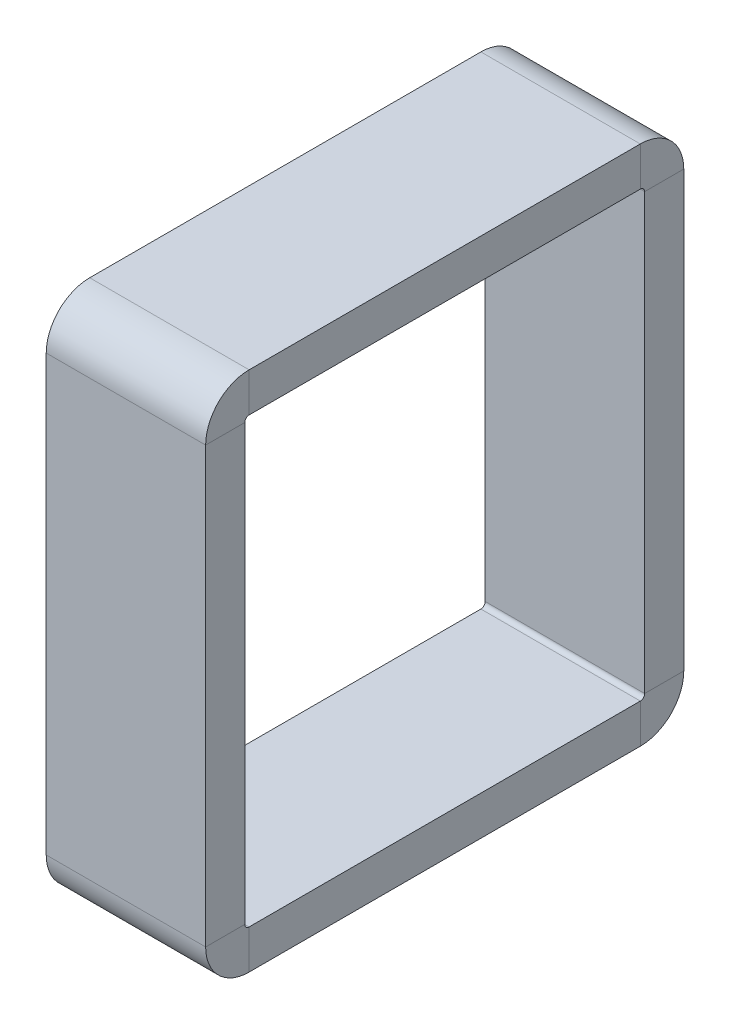
ISO-10303-21;
HEADER;
FILE_DESCRIPTION(('STEP AP214'),'2;1');
FILE_NAME('part.step','',(''),(''),'','','');
FILE_SCHEMA(('AUTOMOTIVE_DESIGN { 1 0 10303 214 1 1 1 1 }'));
ENDSEC;
DATA;
#1=APPLICATION_CONTEXT('core data for automotive mechanical design processes');
#2=APPLICATION_PROTOCOL_DEFINITION('international standard','automotive_design',2000,#1);
#3=PRODUCT_CONTEXT('',#1,'mechanical');
#4=PRODUCT('Part','Part','',(#3));
#5=PRODUCT_RELATED_PRODUCT_CATEGORY('part','',(#4));
#6=PRODUCT_DEFINITION_FORMATION('','',#4);
#7=PRODUCT_DEFINITION_CONTEXT('part definition',#1,'design');
#8=PRODUCT_DEFINITION('design','',#6,#7);
#9=PRODUCT_DEFINITION_SHAPE('','',#8);
#10=(LENGTH_UNIT() NAMED_UNIT(*) SI_UNIT(.MILLI.,.METRE.));
#11=(NAMED_UNIT(*) PLANE_ANGLE_UNIT() SI_UNIT($,.RADIAN.));
#12=(NAMED_UNIT(*) SI_UNIT($,.STERADIAN.) SOLID_ANGLE_UNIT());
#13=UNCERTAINTY_MEASURE_WITH_UNIT(LENGTH_MEASURE(1.E-05),#10,'distance_accuracy_value','');
#14=(GEOMETRIC_REPRESENTATION_CONTEXT(3) GLOBAL_UNCERTAINTY_ASSIGNED_CONTEXT((#13)) GLOBAL_UNIT_ASSIGNED_CONTEXT((#10,
#11,#12)) REPRESENTATION_CONTEXT('',''));
#15=CARTESIAN_POINT('',(0.,0.,0.));
#16=DIRECTION('',(0.,0.,1.));
#17=DIRECTION('',(1.,0.,0.));
#18=AXIS2_PLACEMENT_3D('',#15,#16,#17);
#19=CARTESIAN_POINT('',(-3.716777825355,-0.755000218992055,-3.24612158699929));
#20=DIRECTION('',(1.,0.,0.));
#21=DIRECTION('',(0.,8.74227765734758E-08,-1.));
#22=AXIS2_PLACEMENT_3D('',#19,#20,#21);
#23=PLANE('',#22);
#24=CARTESIAN_POINT('',(-3.716777825355,-0.750000218554938,-3.25112158656218));
#25=DIRECTION('',(-1.,0.,0.));
#26=DIRECTION('',(0.,0.999999999999996,8.74190497768613E-08));
#27=AXIS2_PLACEMENT_3D('',#24,#25,#26);
#28=CIRCLE('',#27,0.00999999999999601);
#29=CARTESIAN_POINT('',(-3.716777825355,-0.740000218554941,-3.25112158568795));
#30=VERTEX_POINT('',#29);
#31=CARTESIAN_POINT('',(-3.716777825355,-0.750000217681714,-3.26112158656218));
#32=VERTEX_POINT('',#31);
#33=EDGE_CURVE('E11',#30,#32,#28,.T.);
#34=ORIENTED_EDGE('',*,*,#33,.F.);
#35=DIRECTION('',(0.,-0.999999999999996,-8.74227801271606E-08));
#36=VECTOR('',#35,1.);
#37=CARTESIAN_POINT('',(-3.716777825355,-0.650000218555942,-3.2511215778209));
#38=LINE('',#37,#36);
#39=CARTESIAN_POINT('',(-3.716777825355,-0.650000218555942,-3.2511215778199));
#40=VERTEX_POINT('',#39);
#41=EDGE_CURVE('E295',#40,#30,#38,.T.);
#42=ORIENTED_EDGE('',*,*,#41,.F.);
#43=CARTESIAN_POINT('',(-3.716777825355,-0.750000218555609,-3.25112158656251));
#44=DIRECTION('',(1.,0.,0.));
#45=DIRECTION('',(0.,8.74290018163099E-08,-0.999999999999996));
#46=AXIS2_PLACEMENT_3D('',#43,#44,#45);
#47=CIRCLE('',#46,0.0999999999996679);
#48=CARTESIAN_POINT('',(-3.716777825355,-0.750000209813664,-3.35112158656218));
#49=VERTEX_POINT('',#48);
#50=EDGE_CURVE('E292',#49,#40,#47,.T.);
#51=ORIENTED_EDGE('',*,*,#50,.F.);
#52=DIRECTION('',(0.,8.74227825933516E-08,-0.999999999999996));
#53=VECTOR('',#52,1.);
#54=CARTESIAN_POINT('',(-3.716777825355,-0.750000217680714,-3.26112158656218));
#55=LINE('',#54,#53);
#56=EDGE_CURVE('E281',#32,#49,#55,.T.);
#57=ORIENTED_EDGE('',*,*,#56,.F.);
#58=EDGE_LOOP('',(#34,#42,#51,#57));
#59=FACE_BOUND('',#58,.T.);
#60=ADVANCED_FACE('F17',(#59),#23,.F.);
#61=CARTESIAN_POINT('',(-3.35,-0.755000218992055,-3.24612158699929));
#62=DIRECTION('',(1.,0.,0.));
#63=DIRECTION('',(0.,8.74227765734758E-08,-1.));
#64=AXIS2_PLACEMENT_3D('',#61,#62,#63);
#65=PLANE('',#64);
#66=DIRECTION('',(0.,8.74227764254459E-08,-0.999999999999996));
#67=VECTOR('',#66,1.);
#68=CARTESIAN_POINT('',(-3.35,-0.750000217680714,-3.26112158656218));
#69=LINE('',#68,#67);
#70=CARTESIAN_POINT('',(-3.35,-0.750000217681714,-3.26112158656218));
#71=VERTEX_POINT('',#70);
#72=CARTESIAN_POINT('',(-3.35,-0.750000209813664,-3.35112158656218));
#73=VERTEX_POINT('',#72);
#74=EDGE_CURVE('E24',#71,#73,#69,.T.);
#75=ORIENTED_EDGE('',*,*,#74,.T.);
#76=CARTESIAN_POINT('',(-3.35,-0.750000218555605,-3.25112158656251));
#77=DIRECTION('',(1.,0.,0.));
#78=DIRECTION('',(0.,8.7429410378383E-08,-0.999999999999996));
#79=AXIS2_PLACEMENT_3D('',#76,#77,#78);
#80=CIRCLE('',#79,0.0999999999996679);
#81=CARTESIAN_POINT('',(-3.35,-0.650000218554941,-3.2511215778199));
#82=VERTEX_POINT('',#81);
#83=EDGE_CURVE('E290',#73,#82,#80,.T.);
#84=ORIENTED_EDGE('',*,*,#83,.T.);
#85=DIRECTION('',(0.,0.999999999999996,8.74227801271606E-08));
#86=VECTOR('',#85,1.);
#87=CARTESIAN_POINT('',(-3.35,-0.740000218554941,-3.25112158568895));
#88=LINE('',#87,#86);
#89=CARTESIAN_POINT('',(-3.35,-0.740000218554941,-3.25112158568795));
#90=VERTEX_POINT('',#89);
#91=EDGE_CURVE('E284',#90,#82,#88,.T.);
#92=ORIENTED_EDGE('',*,*,#91,.F.);
#93=CARTESIAN_POINT('',(-3.35,-0.750000218554892,-3.25112158656223));
#94=DIRECTION('',(-1.,0.,0.));
#95=DIRECTION('',(0.,0.999999999999996,8.74276651075324E-08));
#96=AXIS2_PLACEMENT_3D('',#93,#94,#95);
#97=CIRCLE('',#96,0.00999999999999601);
#98=EDGE_CURVE('E274',#90,#71,#97,.T.);
#99=ORIENTED_EDGE('',*,*,#98,.T.);
#100=EDGE_LOOP('',(#75,#84,#92,#99));
#101=FACE_BOUND('',#100,.T.);
#102=ADVANCED_FACE('F409',(#101),#65,.T.);
#103=CARTESIAN_POINT('',(-3.716777825355,-0.750000218555609,-3.25112158656251));
#104=DIRECTION('',(1.,0.,0.));
#105=DIRECTION('',(0.,-1.,-8.74227765734759E-08));
#106=AXIS2_PLACEMENT_3D('',#103,#104,#105);
#107=CYLINDRICAL_SURFACE('',#106,0.0999999999996679);
#108=ORIENTED_EDGE('',*,*,#50,.T.);
#109=DIRECTION('',(-1.,0.,0.));
#110=VECTOR('',#109,1.);
#111=CARTESIAN_POINT('',(-3.35,-0.650000218555942,-3.2511215778209));
#112=LINE('',#111,#110);
#113=EDGE_CURVE('E287',#82,#40,#112,.T.);
#114=ORIENTED_EDGE('',*,*,#113,.F.);
#115=ORIENTED_EDGE('',*,*,#83,.F.);
#116=DIRECTION('',(1.,0.,0.));
#117=VECTOR('',#116,1.);
#118=CARTESIAN_POINT('',(-3.716777825355,-0.750000209812664,-3.35112158656218));
#119=LINE('',#118,#117);
#120=EDGE_CURVE('E268',#49,#73,#119,.T.);
#121=ORIENTED_EDGE('',*,*,#120,.F.);
#122=EDGE_LOOP('',(#108,#114,#115,#121));
#123=FACE_BOUND('',#122,.T.);
#124=ADVANCED_FACE('F345',(#123),#107,.T.);
#125=CARTESIAN_POINT('',(-3.716777825355,-0.750000218554938,-3.25112158656218));
#126=DIRECTION('',(-1.,-1.22913554664582E-13,1.22913533173692E-13));
#127=DIRECTION('',(1.22913543919138E-13,-1.,-8.74227765734759E-08));
#128=AXIS2_PLACEMENT_3D('',#125,#126,#127);
#129=CYLINDRICAL_SURFACE('',#128,0.00999999999999601);
#130=ORIENTED_EDGE('',*,*,#33,.T.);
#131=DIRECTION('',(1.,1.36334428017066E-12,0.));
#132=VECTOR('',#131,1.);
#133=CARTESIAN_POINT('',(-3.716777825355,-0.750000217680963,-3.26112158656218));
#134=LINE('',#133,#132);
#135=EDGE_CURVE('E276',#32,#71,#134,.T.);
#136=ORIENTED_EDGE('',*,*,#135,.T.);
#137=ORIENTED_EDGE('',*,*,#98,.F.);
#138=DIRECTION('',(1.,0.,0.));
#139=VECTOR('',#138,1.);
#140=CARTESIAN_POINT('',(-3.716777825355,-0.740000218554941,-3.25112158568895));
#141=LINE('',#140,#139);
#142=EDGE_CURVE('E262',#30,#90,#141,.T.);
#143=ORIENTED_EDGE('',*,*,#142,.F.);
#144=EDGE_LOOP('',(#130,#136,#137,#143));
#145=FACE_BOUND('',#144,.T.);
#146=ADVANCED_FACE('F304',(#145),#129,.F.);
#147=CARTESIAN_POINT('',(-3.716777825355,-0.65000029723644,-2.3511215778209));
#148=DIRECTION('',(1.,0.,0.));
#149=DIRECTION('',(0.,-1.,-8.74227765734759E-08));
#150=AXIS2_PLACEMENT_3D('',#147,#148,#149);
#151=PLANE('',#150);
#152=DIRECTION('',(0.,8.7422776548804E-08,-0.999999999999996));
#153=VECTOR('',#152,1.);
#154=CARTESIAN_POINT('',(-3.716777825355,-0.65000029723644,-2.3511215778209));
#155=LINE('',#154,#153);
#156=CARTESIAN_POINT('',(-3.716777825354,-0.65000029723944,-2.3511215778179));
#157=VERTEX_POINT('',#156);
#158=EDGE_CURVE('E278',#157,#40,#155,.T.);
#159=ORIENTED_EDGE('',*,*,#158,.T.);
#160=ORIENTED_EDGE('',*,*,#41,.T.);
#161=DIRECTION('',(0.,8.74227765488039E-08,-0.999999999999996));
#162=VECTOR('',#161,1.);
#163=CARTESIAN_POINT('',(-3.716777825355,-0.74000029723544,-2.35112158568895));
#164=LINE('',#163,#162);
#165=CARTESIAN_POINT('',(-3.716777825354,-0.74000029723844,-2.35112158568595));
#166=VERTEX_POINT('',#165);
#167=EDGE_CURVE('E265',#166,#30,#164,.T.);
#168=ORIENTED_EDGE('',*,*,#167,.F.);
#169=DIRECTION('',(0.,-0.999999999999996,-8.74121663959725E-08));
#170=VECTOR('',#169,1.);
#171=CARTESIAN_POINT('',(-3.716777825354,-0.650000297237395,-2.35112157782185));
#172=LINE('',#171,#170);
#173=EDGE_CURVE('E147',#157,#166,#172,.T.);
#174=ORIENTED_EDGE('',*,*,#173,.F.);
#175=EDGE_LOOP('',(#159,#160,#168,#174));
#176=FACE_BOUND('',#175,.T.);
#177=ADVANCED_FACE('F297',(#176),#151,.F.);
#178=CARTESIAN_POINT('',(-3.35,-0.65000029723644,-2.3511215778209));
#179=DIRECTION('',(0.,-1.,-8.74227765734759E-08));
#180=DIRECTION('',(-1.,0.,0.));
#181=AXIS2_PLACEMENT_3D('',#178,#179,#180);
#182=PLANE('',#181);
#183=DIRECTION('',(0.,8.7422776548804E-08,-0.999999999999996));
#184=VECTOR('',#183,1.);
#185=CARTESIAN_POINT('',(-3.35,-0.65000029723644,-2.3511215778209));
#186=LINE('',#185,#184);
#187=CARTESIAN_POINT('',(-3.350000000001,-0.65000029723944,-2.3511215778179));
#188=VERTEX_POINT('',#187);
#189=EDGE_CURVE('E271',#188,#82,#186,.T.);
#190=ORIENTED_EDGE('',*,*,#189,.T.);
#191=ORIENTED_EDGE('',*,*,#113,.T.);
#192=ORIENTED_EDGE('',*,*,#158,.F.);
#193=DIRECTION('',(-1.,0.,0.));
#194=VECTOR('',#193,1.);
#195=CARTESIAN_POINT('',(-3.35,-0.65000029723644,-2.3511215778209));
#196=LINE('',#195,#194);
#197=EDGE_CURVE('E255',#188,#157,#196,.T.);
#198=ORIENTED_EDGE('',*,*,#197,.F.);
#199=EDGE_LOOP('',(#190,#191,#192,#198));
#200=FACE_BOUND('',#199,.T.);
#201=ADVANCED_FACE('F342',(#200),#182,.F.);
#202=CARTESIAN_POINT('',(-3.716777825355,-0.74000029723544,-2.35112158568895));
#203=DIRECTION('',(0.,1.,8.74227765734759E-08));
#204=DIRECTION('',(1.,0.,0.));
#205=AXIS2_PLACEMENT_3D('',#202,#203,#204);
#206=PLANE('',#205);
#207=ORIENTED_EDGE('',*,*,#167,.T.);
#208=ORIENTED_EDGE('',*,*,#142,.T.);
#209=DIRECTION('',(0.,8.74227765488039E-08,-0.999999999999996));
#210=VECTOR('',#209,1.);
#211=CARTESIAN_POINT('',(-3.35,-0.74000029723544,-2.35112158568895));
#212=LINE('',#211,#210);
#213=CARTESIAN_POINT('',(-3.350000000001,-0.74000029723844,-2.35112158568595));
#214=VERTEX_POINT('',#213);
#215=EDGE_CURVE('E259',#214,#90,#212,.T.);
#216=ORIENTED_EDGE('',*,*,#215,.F.);
#217=DIRECTION('',(1.,0.,0.));
#218=VECTOR('',#217,1.);
#219=CARTESIAN_POINT('',(-3.716777825355,-0.74000029723544,-2.35112158568895));
#220=LINE('',#219,#218);
#221=EDGE_CURVE('E251',#166,#214,#220,.T.);
#222=ORIENTED_EDGE('',*,*,#221,.F.);
#223=EDGE_LOOP('',(#207,#208,#216,#222));
#224=FACE_BOUND('',#223,.T.);
#225=ADVANCED_FACE('F301',(#224),#206,.F.);
#226=CARTESIAN_POINT('',(-3.35,-0.74000029723544,-2.35112158568895));
#227=DIRECTION('',(-1.,0.,0.));
#228=DIRECTION('',(0.,1.,8.74227765734759E-08));
#229=AXIS2_PLACEMENT_3D('',#226,#227,#228);
#230=PLANE('',#229);
#231=ORIENTED_EDGE('',*,*,#215,.T.);
#232=ORIENTED_EDGE('',*,*,#91,.T.);
#233=ORIENTED_EDGE('',*,*,#189,.F.);
#234=DIRECTION('',(0.,0.999999999999996,8.7423199544488E-08));
#235=VECTOR('',#234,1.);
#236=CARTESIAN_POINT('',(-3.350000000001,-0.740000297235708,-2.35112158568899));
#237=LINE('',#236,#235);
#238=EDGE_CURVE('E242',#214,#188,#237,.T.);
#239=ORIENTED_EDGE('',*,*,#238,.F.);
#240=EDGE_LOOP('',(#231,#232,#233,#239));
#241=FACE_BOUND('',#240,.T.);
#242=ADVANCED_FACE('F308',(#241),#230,.F.);
#243=CARTESIAN_POINT('',(-3.716777825355,-1.80000020544153,-3.40112167835709));
#244=DIRECTION('',(-1.,0.,0.));
#245=DIRECTION('',(0.,-8.74227765734759E-08,1.));
#246=AXIS2_PLACEMENT_3D('',#243,#244,#245);
#247=PLANE('',#246);
#248=ORIENTED_EDGE('',*,*,#56,.T.);
#249=DIRECTION('',(0.,-0.999999999999996,-8.74247767512767E-08));
#250=VECTOR('',#249,1.);
#251=CARTESIAN_POINT('',(-3.716777825355,-0.750000209812664,-3.35112158656218));
#252=LINE('',#251,#250);
#253=CARTESIAN_POINT('',(-3.716777825355,-1.75000020981166,-3.35112167398595));
#254=VERTEX_POINT('',#253);
#255=EDGE_CURVE('E253',#49,#254,#252,.T.);
#256=ORIENTED_EDGE('',*,*,#255,.T.);
#257=DIRECTION('',(0.,-8.74338872897881E-08,0.999999999999996));
#258=VECTOR('',#257,1.);
#259=CARTESIAN_POINT('',(-3.716777825355,-1.75000020981266,-3.35112167398695));
#260=LINE('',#259,#258);
#261=CARTESIAN_POINT('',(-3.716777825354,-1.75000021768071,-3.26112167398595));
#262=VERTEX_POINT('',#261);
#263=EDGE_CURVE('E245',#254,#262,#260,.T.);
#264=ORIENTED_EDGE('',*,*,#263,.T.);
#265=DIRECTION('',(0.,0.999999999999996,8.74237762181995E-08));
#266=VECTOR('',#265,1.);
#267=CARTESIAN_POINT('',(-3.716777825355,-1.75000021768171,-3.26112167398595));
#268=LINE('',#267,#266);
#269=EDGE_CURVE('E233',#262,#32,#268,.T.);
#270=ORIENTED_EDGE('',*,*,#269,.T.);
#271=EDGE_LOOP('',(#248,#256,#264,#270));
#272=FACE_BOUND('',#271,.T.);
#273=ADVANCED_FACE('F350',(#272),#247,.T.);
#274=CARTESIAN_POINT('',(-3.716777825355,-0.750000209812664,-3.35112158656218));
#275=DIRECTION('',(0.,-8.7424776751277E-08,1.));
#276=DIRECTION('',(0.,-1.,-8.7424776751277E-08));
#277=AXIS2_PLACEMENT_3D('',#274,#275,#276);
#278=PLANE('',#277);
#279=ORIENTED_EDGE('',*,*,#120,.T.);
#280=DIRECTION('',(0.,-0.999999999999996,-8.74247767512767E-08));
#281=VECTOR('',#280,1.);
#282=CARTESIAN_POINT('',(-3.35,-0.750000209812664,-3.35112158656218));
#283=LINE('',#282,#281);
#284=CARTESIAN_POINT('',(-3.350000000001,-1.75000020981166,-3.35112167398595));
#285=VERTEX_POINT('',#284);
#286=EDGE_CURVE('E247',#73,#285,#283,.T.);
#287=ORIENTED_EDGE('',*,*,#286,.T.);
#288=DIRECTION('',(1.,0.,0.));
#289=VECTOR('',#288,1.);
#290=CARTESIAN_POINT('',(-3.716777825355,-1.75000020981266,-3.35112167398695));
#291=LINE('',#290,#289);
#292=EDGE_CURVE('E236',#254,#285,#291,.T.);
#293=ORIENTED_EDGE('',*,*,#292,.F.);
#294=ORIENTED_EDGE('',*,*,#255,.F.);
#295=EDGE_LOOP('',(#279,#287,#293,#294));
#296=FACE_BOUND('',#295,.T.);
#297=ADVANCED_FACE('F364',(#296),#278,.F.);
#298=CARTESIAN_POINT('',(-3.716777825355,-1.75000021768171,-3.26112167398595));
#299=DIRECTION('',(0.,8.74237762182872E-08,-1.));
#300=DIRECTION('',(0.,1.,8.74237762182872E-08));
#301=AXIS2_PLACEMENT_3D('',#298,#299,#300);
#302=PLANE('',#301);
#303=DIRECTION('',(1.,1.36334428017066E-12,0.));
#304=VECTOR('',#303,1.);
#305=CARTESIAN_POINT('',(-3.716777825355,-1.75000021768146,-3.26112167398595));
#306=LINE('',#305,#304);
#307=CARTESIAN_POINT('',(-3.350000000001,-1.75000021767971,-3.26112167398595));
#308=VERTEX_POINT('',#307);
#309=EDGE_CURVE('E249',#262,#308,#306,.T.);
#310=ORIENTED_EDGE('',*,*,#309,.T.);
#311=DIRECTION('',(0.,0.999999999999996,8.74237762182432E-08));
#312=VECTOR('',#311,1.);
#313=CARTESIAN_POINT('',(-3.35,-1.75000021768096,-3.26112167398595));
#314=LINE('',#313,#312);
#315=EDGE_CURVE('E239',#308,#71,#314,.T.);
#316=ORIENTED_EDGE('',*,*,#315,.T.);
#317=ORIENTED_EDGE('',*,*,#135,.F.);
#318=ORIENTED_EDGE('',*,*,#269,.F.);
#319=EDGE_LOOP('',(#310,#316,#317,#318));
#320=FACE_BOUND('',#319,.T.);
#321=ADVANCED_FACE('F355',(#320),#302,.F.);
#322=CARTESIAN_POINT('',(-3.35,-1.80000020544153,-3.40112167835709));
#323=DIRECTION('',(-1.,0.,0.));
#324=DIRECTION('',(0.,-8.74227765734759E-08,1.));
#325=AXIS2_PLACEMENT_3D('',#322,#323,#324);
#326=PLANE('',#325);
#327=ORIENTED_EDGE('',*,*,#315,.F.);
#328=DIRECTION('',(0.,-8.74333864567739E-08,0.999999999999996));
#329=VECTOR('',#328,1.);
#330=CARTESIAN_POINT('',(-3.35,-1.75000020981171,-3.351121673986));
#331=LINE('',#330,#329);
#332=EDGE_CURVE('E228',#285,#308,#331,.T.);
#333=ORIENTED_EDGE('',*,*,#332,.F.);
#334=ORIENTED_EDGE('',*,*,#286,.F.);
#335=ORIENTED_EDGE('',*,*,#74,.F.);
#336=EDGE_LOOP('',(#327,#333,#334,#335));
#337=FACE_BOUND('',#336,.T.);
#338=ADVANCED_FACE('F361',(#337),#326,.F.);
#339=CARTESIAN_POINT('',(-3.716777825355,-1.85500021899106,-3.24612168316634));
#340=DIRECTION('',(1.,0.,0.));
#341=DIRECTION('',(0.,8.74227765734759E-08,-1.));
#342=AXIS2_PLACEMENT_3D('',#339,#340,#341);
#343=PLANE('',#342);
#344=CARTESIAN_POINT('',(-3.716777825355,-1.75000021855494,-3.25112167398596));
#345=DIRECTION('',(-1.,0.,0.));
#346=DIRECTION('',(0.,8.74249561633349E-08,-0.999999999999996));
#347=AXIS2_PLACEMENT_3D('',#344,#345,#346);
#348=CIRCLE('',#347,0.00999999999999801);
#349=CARTESIAN_POINT('',(-3.716777825354,-1.76000021855494,-3.25112167486018));
#350=VERTEX_POINT('',#349);
#351=EDGE_CURVE('E231',#262,#350,#348,.T.);
#352=ORIENTED_EDGE('',*,*,#351,.F.);
#353=ORIENTED_EDGE('',*,*,#263,.F.);
#354=CARTESIAN_POINT('',(-3.716777825355,-1.75000021855514,-3.25112167398716));
#355=DIRECTION('',(1.,0.,0.));
#356=DIRECTION('',(0.,-0.999999999999996,-8.74205197131629E-08));
#357=AXIS2_PLACEMENT_3D('',#354,#355,#356);
#358=CIRCLE('',#357,0.0999999999987971);
#359=CARTESIAN_POINT('',(-3.716777825354,-1.85000021855394,-3.25112168272823));
#360=VERTEX_POINT('',#359);
#361=EDGE_CURVE('E225',#360,#254,#358,.T.);
#362=ORIENTED_EDGE('',*,*,#361,.F.);
#363=DIRECTION('',(0.,-0.999999999999996,-8.7433882357407E-08));
#364=VECTOR('',#363,1.);
#365=CARTESIAN_POINT('',(-3.716777825355,-1.76000021855494,-3.25112167486018));
#366=LINE('',#365,#364);
#367=EDGE_CURVE('E215',#350,#360,#366,.T.);
#368=ORIENTED_EDGE('',*,*,#367,.F.);
#369=EDGE_LOOP('',(#352,#353,#362,#368));
#370=FACE_BOUND('',#369,.T.);
#371=ADVANCED_FACE('F372',(#370),#343,.F.);
#372=CARTESIAN_POINT('',(-3.716777825355,-1.75000021855514,-3.25112167398716));
#373=DIRECTION('',(1.,0.,0.));
#374=DIRECTION('',(0.,-1.,-8.74227765734759E-08));
#375=AXIS2_PLACEMENT_3D('',#372,#373,#374);
#376=CYLINDRICAL_SURFACE('',#375,0.0999999999987971);
#377=ORIENTED_EDGE('',*,*,#361,.T.);
#378=ORIENTED_EDGE('',*,*,#292,.T.);
#379=CARTESIAN_POINT('',(-3.35,-1.75000021855515,-3.25112167398716));
#380=DIRECTION('',(1.,0.,0.));
#381=DIRECTION('',(0.,-0.999999999999996,-8.74204753042419E-08));
#382=AXIS2_PLACEMENT_3D('',#379,#380,#381);
#383=CIRCLE('',#382,0.0999999999987971);
#384=CARTESIAN_POINT('',(-3.350000000001,-1.85000021855394,-3.25112168272823));
#385=VERTEX_POINT('',#384);
#386=EDGE_CURVE('E218',#385,#285,#383,.T.);
#387=ORIENTED_EDGE('',*,*,#386,.F.);
#388=DIRECTION('',(1.,0.,0.));
#389=VECTOR('',#388,1.);
#390=CARTESIAN_POINT('',(-3.716777825355,-1.85000021855394,-3.25112168272923));
#391=LINE('',#390,#389);
#392=EDGE_CURVE('E209',#360,#385,#391,.T.);
#393=ORIENTED_EDGE('',*,*,#392,.F.);
#394=EDGE_LOOP('',(#377,#378,#387,#393));
#395=FACE_BOUND('',#394,.T.);
#396=ADVANCED_FACE('F368',(#395),#376,.T.);
#397=CARTESIAN_POINT('',(-3.716777825355,-1.75000021855494,-3.25112167398596));
#398=DIRECTION('',(-1.,1.229135331737E-13,1.22913554664589E-13));
#399=DIRECTION('',(-1.22913543919143E-13,-1.,-8.74227765734759E-08));
#400=AXIS2_PLACEMENT_3D('',#397,#398,#399);
#401=CYLINDRICAL_SURFACE('',#400,0.00999999999999801);
#402=ORIENTED_EDGE('',*,*,#351,.T.);
#403=DIRECTION('',(1.,2.72668856034131E-12,0.));
#404=VECTOR('',#403,1.);
#405=CARTESIAN_POINT('',(-3.716777825355,-1.76000021855494,-3.25112167486018));
#406=LINE('',#405,#404);
#407=CARTESIAN_POINT('',(-3.350000000001,-1.76000021855394,-3.25112167486018));
#408=VERTEX_POINT('',#407);
#409=EDGE_CURVE('E221',#350,#408,#406,.T.);
#410=ORIENTED_EDGE('',*,*,#409,.T.);
#411=CARTESIAN_POINT('',(-3.35,-1.75000021855499,-3.251121673986));
#412=DIRECTION('',(-1.,0.,0.));
#413=DIRECTION('',(0.,8.75294947633336E-08,-0.999999999999996));
#414=AXIS2_PLACEMENT_3D('',#411,#412,#413);
#415=CIRCLE('',#414,0.00999999999999801);
#416=EDGE_CURVE('E212',#308,#408,#415,.T.);
#417=ORIENTED_EDGE('',*,*,#416,.F.);
#418=ORIENTED_EDGE('',*,*,#309,.F.);
#419=EDGE_LOOP('',(#402,#410,#417,#418));
#420=FACE_BOUND('',#419,.T.);
#421=ADVANCED_FACE('F374',(#420),#401,.F.);
#422=CARTESIAN_POINT('',(-3.35,-1.85500021899106,-3.24612168316634));
#423=DIRECTION('',(1.,0.,0.));
#424=DIRECTION('',(0.,8.74227765734759E-08,-1.));
#425=AXIS2_PLACEMENT_3D('',#422,#423,#424);
#426=PLANE('',#425);
#427=DIRECTION('',(0.,-0.999999999999996,-8.7434893892964E-08));
#428=VECTOR('',#427,1.);
#429=CARTESIAN_POINT('',(-3.35,-1.76000021855394,-3.25112167486009));
#430=LINE('',#429,#428);
#431=EDGE_CURVE('E223',#408,#385,#430,.T.);
#432=ORIENTED_EDGE('',*,*,#431,.T.);
#433=ORIENTED_EDGE('',*,*,#386,.T.);
#434=ORIENTED_EDGE('',*,*,#332,.T.);
#435=ORIENTED_EDGE('',*,*,#416,.T.);
#436=EDGE_LOOP('',(#432,#433,#434,#435));
#437=FACE_BOUND('',#436,.T.);
#438=ADVANCED_FACE('F377',(#437),#426,.T.);
#439=CARTESIAN_POINT('',(-3.716777825355,-1.89500021462292,-3.29612168666326));
#440=DIRECTION('',(-1.,0.,0.));
#441=DIRECTION('',(0.,-8.74227765734759E-08,1.));
#442=AXIS2_PLACEMENT_3D('',#439,#440,#441);
#443=PLANE('',#442);
#444=ORIENTED_EDGE('',*,*,#367,.T.);
#445=DIRECTION('',(0.,-8.74261100551144E-08,0.999999999999996));
#446=VECTOR('',#445,1.);
#447=CARTESIAN_POINT('',(-3.716777825355,-1.85000021855394,-3.25112168272923));
#448=LINE('',#447,#446);
#449=CARTESIAN_POINT('',(-3.716777825354,-1.85000029723744,-2.35112168273023));
#450=VERTEX_POINT('',#449);
#451=EDGE_CURVE('E207',#360,#450,#448,.T.);
#452=ORIENTED_EDGE('',*,*,#451,.T.);
#453=DIRECTION('',(0.,0.999999999999996,8.74227653232155E-08));
#454=VECTOR('',#453,1.);
#455=CARTESIAN_POINT('',(-3.716777825355,-1.85000029723744,-2.35112168272923));
#456=LINE('',#455,#454);
#457=CARTESIAN_POINT('',(-3.716777825354,-1.76000029723744,-2.35112167486118));
#458=VERTEX_POINT('',#457);
#459=EDGE_CURVE('E201',#450,#458,#456,.T.);
#460=ORIENTED_EDGE('',*,*,#459,.T.);
#461=DIRECTION('',(0.,8.74249985986058E-08,-0.999999999999996));
#462=VECTOR('',#461,1.);
#463=CARTESIAN_POINT('',(-3.716777825355,-1.76000029723744,-2.35112167486118));
#464=LINE('',#463,#462);
#465=EDGE_CURVE('E192',#458,#350,#464,.T.);
#466=ORIENTED_EDGE('',*,*,#465,.T.);
#467=EDGE_LOOP('',(#444,#452,#460,#466));
#468=FACE_BOUND('',#467,.T.);
#469=ADVANCED_FACE('F397',(#468),#443,.T.);
#470=CARTESIAN_POINT('',(-3.716777825355,-1.85000021855394,-3.25112168272923));
#471=DIRECTION('',(0.,1.,8.74261099564282E-08));
#472=DIRECTION('',(0.,-8.74261099564282E-08,1.));
#473=AXIS2_PLACEMENT_3D('',#470,#471,#472);
#474=PLANE('',#473);
#475=ORIENTED_EDGE('',*,*,#392,.T.);
#476=DIRECTION('',(0.,-8.74261100551145E-08,0.999999999999996));
#477=VECTOR('',#476,1.);
#478=CARTESIAN_POINT('',(-3.35,-1.85000021855394,-3.25112168272923));
#479=LINE('',#478,#477);
#480=CARTESIAN_POINT('',(-3.350000000001,-1.85000029723744,-2.35112168273023));
#481=VERTEX_POINT('',#480);
#482=EDGE_CURVE('E203',#385,#481,#479,.T.);
#483=ORIENTED_EDGE('',*,*,#482,.T.);
#484=DIRECTION('',(1.,0.,0.));
#485=VECTOR('',#484,1.);
#486=CARTESIAN_POINT('',(-3.716777825355,-1.85000029723744,-2.35112168272923));
#487=LINE('',#486,#485);
#488=EDGE_CURVE('E195',#450,#481,#487,.T.);
#489=ORIENTED_EDGE('',*,*,#488,.F.);
#490=ORIENTED_EDGE('',*,*,#451,.F.);
#491=EDGE_LOOP('',(#475,#483,#489,#490));
#492=FACE_BOUND('',#491,.T.);
#493=ADVANCED_FACE('F381',(#492),#474,.F.);
#494=CARTESIAN_POINT('',(-3.716777825355,-1.76000029723744,-2.35112167486118));
#495=DIRECTION('',(2.72668856034131E-12,-1.,-8.74249987465387E-08));
#496=DIRECTION('',(0.,8.74249987465387E-08,-1.));
#497=AXIS2_PLACEMENT_3D('',#494,#495,#496);
#498=PLANE('',#497);
#499=DIRECTION('',(1.,2.72668856034131E-12,0.));
#500=VECTOR('',#499,1.);
#501=CARTESIAN_POINT('',(-3.716777825355,-1.76000029723744,-2.35112167486118));
#502=LINE('',#501,#500);
#503=CARTESIAN_POINT('',(-3.350000000001,-1.76000029723744,-2.35112167486118));
#504=VERTEX_POINT('',#503);
#505=EDGE_CURVE('E205',#458,#504,#502,.T.);
#506=ORIENTED_EDGE('',*,*,#505,.T.);
#507=DIRECTION('',(0.,8.7424998845322E-08,-0.999999999999996));
#508=VECTOR('',#507,1.);
#509=CARTESIAN_POINT('',(-3.35,-1.76000029723644,-2.35112167486118));
#510=LINE('',#509,#508);
#511=EDGE_CURVE('E198',#504,#408,#510,.T.);
#512=ORIENTED_EDGE('',*,*,#511,.T.);
#513=ORIENTED_EDGE('',*,*,#409,.F.);
#514=ORIENTED_EDGE('',*,*,#465,.F.);
#515=EDGE_LOOP('',(#506,#512,#513,#514));
#516=FACE_BOUND('',#515,.T.);
#517=ADVANCED_FACE('F398',(#516),#498,.F.);
#518=CARTESIAN_POINT('',(-3.35,-1.89500021462292,-3.29612168666326));
#519=DIRECTION('',(-1.,0.,0.));
#520=DIRECTION('',(0.,-8.74227765734759E-08,1.));
#521=AXIS2_PLACEMENT_3D('',#518,#519,#520);
#522=PLANE('',#521);
#523=ORIENTED_EDGE('',*,*,#511,.F.);
#524=DIRECTION('',(0.,0.999999999999996,8.74227751918646E-08));
#525=VECTOR('',#524,1.);
#526=CARTESIAN_POINT('',(-3.350000000001,-1.85000029723744,-2.35112168272923));
#527=LINE('',#526,#525);
#528=EDGE_CURVE('E187',#481,#504,#527,.T.);
#529=ORIENTED_EDGE('',*,*,#528,.F.);
#530=ORIENTED_EDGE('',*,*,#482,.F.);
#531=ORIENTED_EDGE('',*,*,#431,.F.);
#532=EDGE_LOOP('',(#523,#529,#530,#531));
#533=FACE_BOUND('',#532,.T.);
#534=ADVANCED_FACE('F385',(#533),#522,.F.);
#535=CARTESIAN_POINT('',(-3.716777825354,-1.85500030641683,-2.24612168316734));
#536=DIRECTION('',(1.,0.,0.));
#537=DIRECTION('',(0.,8.74227765734759E-08,-1.));
#538=AXIS2_PLACEMENT_3D('',#535,#536,#537);
#539=PLANE('',#538);
#540=CARTESIAN_POINT('',(-3.716777825354,-1.75000029723744,-2.35112167398695));
#541=DIRECTION('',(-1.,0.,0.));
#542=DIRECTION('',(0.,-0.999999999999996,-8.74229577618769E-08));
#543=AXIS2_PLACEMENT_3D('',#540,#541,#542);
#544=CIRCLE('',#543,0.00999999999999957);
#545=CARTESIAN_POINT('',(-3.716777825354,-1.75000029811067,-2.34112167398695));
#546=VERTEX_POINT('',#545);
#547=EDGE_CURVE('E190',#458,#546,#544,.T.);
#548=ORIENTED_EDGE('',*,*,#547,.F.);
#549=ORIENTED_EDGE('',*,*,#459,.F.);
#550=CARTESIAN_POINT('',(-3.716777825354,-1.75000029723746,-2.35112167398793));
#551=DIRECTION('',(1.,0.,0.));
#552=DIRECTION('',(0.,-8.74225336566994E-08,0.999999999999996));
#553=AXIS2_PLACEMENT_3D('',#550,#551,#552);
#554=CIRCLE('',#553,0.0999999999999757);
#555=CARTESIAN_POINT('',(-3.716777825354,-1.75000030597972,-2.25112167398795));
#556=VERTEX_POINT('',#555);
#557=EDGE_CURVE('E184',#556,#450,#554,.T.);
#558=ORIENTED_EDGE('',*,*,#557,.F.);
#559=DIRECTION('',(0.,-8.74343930599545E-08,0.999999999999996));
#560=VECTOR('',#559,1.);
#561=CARTESIAN_POINT('',(-3.716777825354,-1.75000029811162,-2.341121673987));
#562=LINE('',#561,#560);
#563=EDGE_CURVE('E176',#546,#556,#562,.T.);
#564=ORIENTED_EDGE('',*,*,#563,.F.);
#565=EDGE_LOOP('',(#548,#549,#558,#564));
#566=FACE_BOUND('',#565,.T.);
#567=ADVANCED_FACE('F395',(#566),#539,.F.);
#568=CARTESIAN_POINT('',(-3.716777825354,-1.75000029723746,-2.35112167398793));
#569=DIRECTION('',(1.,0.,0.));
#570=DIRECTION('',(0.,-1.,-8.74227765734759E-08));
#571=AXIS2_PLACEMENT_3D('',#568,#569,#570);
#572=CYLINDRICAL_SURFACE('',#571,0.0999999999999757);
#573=ORIENTED_EDGE('',*,*,#557,.T.);
#574=ORIENTED_EDGE('',*,*,#488,.T.);
#575=CARTESIAN_POINT('',(-3.350000000001,-1.75000029723747,-2.35112167398792));
#576=DIRECTION('',(1.,0.,0.));
#577=DIRECTION('',(0.,-8.74224892477784E-08,0.999999999999996));
#578=AXIS2_PLACEMENT_3D('',#575,#576,#577);
#579=CIRCLE('',#578,0.0999999999999757);
#580=CARTESIAN_POINT('',(-3.350000000001,-1.75000030597972,-2.25112167398795));
#581=VERTEX_POINT('',#580);
#582=EDGE_CURVE('E178',#581,#481,#579,.T.);
#583=ORIENTED_EDGE('',*,*,#582,.F.);
#584=DIRECTION('',(1.,1.36334428017809E-12,0.));
#585=VECTOR('',#584,1.);
#586=CARTESIAN_POINT('',(-3.716777825354,-1.75000030598047,-2.25112167398795));
#587=LINE('',#586,#585);
#588=EDGE_CURVE('E167',#556,#581,#587,.T.);
#589=ORIENTED_EDGE('',*,*,#588,.F.);
#590=EDGE_LOOP('',(#573,#574,#583,#589));
#591=FACE_BOUND('',#590,.T.);
#592=ADVANCED_FACE('F335',(#591),#572,.T.);
#593=CARTESIAN_POINT('',(-3.716777825354,-1.75000029723744,-2.35112167398695));
#594=DIRECTION('',(-1.,1.22913554664589E-13,-1.229135331737E-13));
#595=DIRECTION('',(-1.22913543919146E-13,-1.,-8.74227765734759E-08));
#596=AXIS2_PLACEMENT_3D('',#593,#594,#595);
#597=CYLINDRICAL_SURFACE('',#596,0.00999999999999957);
#598=ORIENTED_EDGE('',*,*,#547,.T.);
#599=DIRECTION('',(1.,0.,0.));
#600=VECTOR('',#599,1.);
#601=CARTESIAN_POINT('',(-3.716777825354,-1.75000029811167,-2.34112167398695));
#602=LINE('',#601,#600);
#603=CARTESIAN_POINT('',(-3.350000000001,-1.75000029811067,-2.34112167398695));
#604=VERTEX_POINT('',#603);
#605=EDGE_CURVE('E158',#546,#604,#602,.T.);
#606=ORIENTED_EDGE('',*,*,#605,.T.);
#607=CARTESIAN_POINT('',(-3.350000000001,-1.75000029723749,-2.35112167398691));
#608=DIRECTION('',(-1.,0.,0.));
#609=DIRECTION('',(0.,-0.999999999999996,-8.74274874718174E-08));
#610=AXIS2_PLACEMENT_3D('',#607,#608,#609);
#611=CIRCLE('',#610,0.00999999999999957);
#612=EDGE_CURVE('E173',#504,#604,#611,.T.);
#613=ORIENTED_EDGE('',*,*,#612,.F.);
#614=ORIENTED_EDGE('',*,*,#505,.F.);
#615=EDGE_LOOP('',(#598,#606,#613,#614));
#616=FACE_BOUND('',#615,.T.);
#617=ADVANCED_FACE('F389',(#616),#597,.F.);
#618=CARTESIAN_POINT('',(-3.350000000001,-1.85500030641683,-2.24612168316734));
#619=DIRECTION('',(1.,0.,0.));
#620=DIRECTION('',(0.,8.74227765734759E-08,-1.));
#621=AXIS2_PLACEMENT_3D('',#618,#619,#620);
#622=PLANE('',#621);
#623=DIRECTION('',(0.,-8.74227727256735E-08,0.999999999999996));
#624=VECTOR('',#623,1.);
#625=CARTESIAN_POINT('',(-3.350000000001,-1.75000029811167,-2.34112167398695));
#626=LINE('',#625,#624);
#627=EDGE_CURVE('E182',#604,#581,#626,.T.);
#628=ORIENTED_EDGE('',*,*,#627,.T.);
#629=ORIENTED_EDGE('',*,*,#582,.T.);
#630=ORIENTED_EDGE('',*,*,#528,.T.);
#631=ORIENTED_EDGE('',*,*,#612,.T.);
#632=EDGE_LOOP('',(#628,#629,#630,#631));
#633=FACE_BOUND('',#632,.T.);
#634=ADVANCED_FACE('F331',(#633),#622,.T.);
#635=CARTESIAN_POINT('',(-3.716777825354,-1.80000029374153,-2.39112167835809));
#636=DIRECTION('',(-1.,0.,0.));
#637=DIRECTION('',(0.,-8.74227765734759E-08,1.));
#638=AXIS2_PLACEMENT_3D('',#635,#636,#637);
#639=PLANE('',#638);
#640=ORIENTED_EDGE('',*,*,#563,.T.);
#641=DIRECTION('',(0.,0.999999999999996,8.74268057947961E-08));
#642=VECTOR('',#641,1.);
#643=CARTESIAN_POINT('',(-3.716777825354,-1.75000030598064,-2.25112167398798));
#644=LINE('',#643,#642);
#645=CARTESIAN_POINT('',(-3.716777825354,-0.750000305980718,-2.25112158656118));
#646=VERTEX_POINT('',#645);
#647=EDGE_CURVE('E135',#556,#646,#644,.T.);
#648=ORIENTED_EDGE('',*,*,#647,.T.);
#649=DIRECTION('',(0.,8.74224125202244E-08,-0.999999999999996));
#650=VECTOR('',#649,1.);
#651=CARTESIAN_POINT('',(-3.716777825354,-0.750000305979685,-2.25112158656143));
#652=LINE('',#651,#650);
#653=CARTESIAN_POINT('',(-3.716777825354,-0.750000298112668,-2.34112158656018));
#654=VERTEX_POINT('',#653);
#655=EDGE_CURVE('E127',#646,#654,#652,.T.);
#656=ORIENTED_EDGE('',*,*,#655,.T.);
#657=DIRECTION('',(0.,-0.999999999999996,-8.74266858907895E-08));
#658=VECTOR('',#657,1.);
#659=CARTESIAN_POINT('',(-3.716777825354,-0.750000298111664,-2.34112158656027));
#660=LINE('',#659,#658);
#661=EDGE_CURVE('E132',#654,#546,#660,.T.);
#662=ORIENTED_EDGE('',*,*,#661,.T.);
#663=EDGE_LOOP('',(#640,#648,#656,#662));
#664=FACE_BOUND('',#663,.T.);
#665=ADVANCED_FACE('F130',(#664),#639,.T.);
#666=CARTESIAN_POINT('',(-3.716777825354,-1.75000030598072,-2.25112167398795));
#667=DIRECTION('',(0.,8.74267769290782E-08,-1.));
#668=DIRECTION('',(0.,1.,8.74267769290782E-08));
#669=AXIS2_PLACEMENT_3D('',#666,#667,#668);
#670=PLANE('',#669);
#671=ORIENTED_EDGE('',*,*,#588,.T.);
#672=DIRECTION('',(0.,0.999999999999996,8.74267769290341E-08));
#673=VECTOR('',#672,1.);
#674=CARTESIAN_POINT('',(-3.350000000001,-1.75000030597997,-2.25112167398795));
#675=LINE('',#674,#673);
#676=CARTESIAN_POINT('',(-3.350000000001,-0.750000305980718,-2.25112158656118));
#677=VERTEX_POINT('',#676);
#678=EDGE_CURVE('E139',#581,#677,#675,.T.);
#679=ORIENTED_EDGE('',*,*,#678,.T.);
#680=DIRECTION('',(1.,1.36334428017809E-12,0.));
#681=VECTOR('',#680,1.);
#682=CARTESIAN_POINT('',(-3.716777825354,-0.750000305979968,-2.25112158656118));
#683=LINE('',#682,#681);
#684=EDGE_CURVE('E159',#646,#677,#683,.T.);
#685=ORIENTED_EDGE('',*,*,#684,.F.);
#686=ORIENTED_EDGE('',*,*,#647,.F.);
#687=EDGE_LOOP('',(#671,#679,#685,#686));
#688=FACE_BOUND('',#687,.T.);
#689=ADVANCED_FACE('F338',(#688),#670,.F.);
#690=CARTESIAN_POINT('',(-3.716777825354,-0.750000298111668,-2.34112158656018));
#691=DIRECTION('',(0.,-8.7426776484989E-08,1.));
#692=DIRECTION('',(0.,-1.,-8.7426776484989E-08));
#693=AXIS2_PLACEMENT_3D('',#690,#691,#692);
#694=PLANE('',#693);
#695=DIRECTION('',(1.,0.,0.));
#696=VECTOR('',#695,1.);
#697=CARTESIAN_POINT('',(-3.716777825354,-0.750000298111668,-2.34112158656018));
#698=LINE('',#697,#696);
#699=CARTESIAN_POINT('',(-3.350000000001,-0.750000298112668,-2.34112158656018));
#700=VERTEX_POINT('',#699);
#701=EDGE_CURVE('E156',#654,#700,#698,.T.);
#702=ORIENTED_EDGE('',*,*,#701,.T.);
#703=DIRECTION('',(0.,-0.999999999999996,-8.74267764849886E-08));
#704=VECTOR('',#703,1.);
#705=CARTESIAN_POINT('',(-3.350000000001,-0.750000298111668,-2.34112158656018));
#706=LINE('',#705,#704);
#707=EDGE_CURVE('E140',#700,#604,#706,.T.);
#708=ORIENTED_EDGE('',*,*,#707,.T.);
#709=ORIENTED_EDGE('',*,*,#605,.F.);
#710=ORIENTED_EDGE('',*,*,#661,.F.);
#711=EDGE_LOOP('',(#702,#708,#709,#710));
#712=FACE_BOUND('',#711,.T.);
#713=ADVANCED_FACE('F154',(#712),#694,.F.);
#714=CARTESIAN_POINT('',(-3.350000000001,-1.80000029374053,-2.39112167835809));
#715=DIRECTION('',(-1.,0.,0.));
#716=DIRECTION('',(0.,-8.74227765734759E-08,1.));
#717=AXIS2_PLACEMENT_3D('',#714,#715,#716);
#718=PLANE('',#717);
#719=ORIENTED_EDGE('',*,*,#707,.F.);
#720=DIRECTION('',(0.,8.7423280961147E-08,-0.999999999999996));
#721=VECTOR('',#720,1.);
#722=CARTESIAN_POINT('',(-3.350000000001,-0.750000305979764,-2.25112158656122));
#723=LINE('',#722,#721);
#724=EDGE_CURVE('E151',#677,#700,#723,.T.);
#725=ORIENTED_EDGE('',*,*,#724,.F.);
#726=ORIENTED_EDGE('',*,*,#678,.F.);
#727=ORIENTED_EDGE('',*,*,#627,.F.);
#728=EDGE_LOOP('',(#719,#725,#726,#727));
#729=FACE_BOUND('',#728,.T.);
#730=ADVANCED_FACE('F328',(#729),#718,.F.);
#731=CARTESIAN_POINT('',(-3.716777825354,-0.755000306417832,-2.24612158699729));
#732=DIRECTION('',(1.,0.,0.));
#733=DIRECTION('',(0.,8.74227765734759E-08,-1.));
#734=AXIS2_PLACEMENT_3D('',#731,#732,#733);
#735=PLANE('',#734);
#736=CARTESIAN_POINT('',(-3.716777825354,-0.750000297238439,-2.35112158656017));
#737=DIRECTION('',(-1.,0.,0.));
#738=DIRECTION('',(0.,-8.74274874718271E-08,0.999999999999996));
#739=AXIS2_PLACEMENT_3D('',#736,#737,#738);
#740=CIRCLE('',#739,0.00999999999999845);
#741=EDGE_CURVE('E144',#654,#166,#740,.T.);
#742=ORIENTED_EDGE('',*,*,#741,.F.);
#743=ORIENTED_EDGE('',*,*,#655,.F.);
#744=CARTESIAN_POINT('',(-3.716777825354,-0.750000297237544,-2.35112158655928));
#745=DIRECTION('',(1.,0.,0.));
#746=DIRECTION('',(0.,0.999999999999996,8.7409035566802E-08));
#747=AXIS2_PLACEMENT_3D('',#744,#745,#746);
#748=CIRCLE('',#747,0.0999999999981039);
#749=EDGE_CURVE('E317',#157,#646,#748,.T.);
#750=ORIENTED_EDGE('',*,*,#749,.F.);
#751=ORIENTED_EDGE('',*,*,#173,.T.);
#752=EDGE_LOOP('',(#742,#743,#750,#751));
#753=FACE_BOUND('',#752,.T.);
#754=ADVANCED_FACE('F145',(#753),#735,.F.);
#755=CARTESIAN_POINT('',(-3.716777825354,-0.750000297237544,-2.35112158655928));
#756=DIRECTION('',(1.,0.,0.));
#757=DIRECTION('',(0.,-1.,-8.74227765734759E-08));
#758=AXIS2_PLACEMENT_3D('',#755,#756,#757);
#759=CYLINDRICAL_SURFACE('',#758,0.0999999999981039);
#760=ORIENTED_EDGE('',*,*,#749,.T.);
#761=ORIENTED_EDGE('',*,*,#684,.T.);
#762=CARTESIAN_POINT('',(-3.350000000001,-0.75000029723754,-2.35112158655927));
#763=DIRECTION('',(1.,0.,0.));
#764=DIRECTION('',(0.,0.999999999999996,8.7408991157881E-08));
#765=AXIS2_PLACEMENT_3D('',#762,#763,#764);
#766=CIRCLE('',#765,0.0999999999981039);
#767=EDGE_CURVE('E315',#188,#677,#766,.T.);
#768=ORIENTED_EDGE('',*,*,#767,.F.);
#769=ORIENTED_EDGE('',*,*,#197,.T.);
#770=EDGE_LOOP('',(#760,#761,#768,#769));
#771=FACE_BOUND('',#770,.T.);
#772=ADVANCED_FACE('F340',(#771),#759,.T.);
#773=CARTESIAN_POINT('',(-3.716777825354,-0.750000297238439,-2.35112158656017));
#774=DIRECTION('',(-1.,-1.22913533173715E-13,-1.22913554664604E-13));
#775=DIRECTION('',(1.22913543919158E-13,-1.,-8.74227765734759E-08));
#776=AXIS2_PLACEMENT_3D('',#773,#774,#775);
#777=CYLINDRICAL_SURFACE('',#776,0.00999999999999845);
#778=ORIENTED_EDGE('',*,*,#741,.T.);
#779=ORIENTED_EDGE('',*,*,#221,.T.);
#780=CARTESIAN_POINT('',(-3.350000000001,-0.750000297238393,-2.35112158656013));
#781=DIRECTION('',(-1.,0.,0.));
#782=DIRECTION('',(0.,-8.74319949773071E-08,0.999999999999996));
#783=AXIS2_PLACEMENT_3D('',#780,#781,#782);
#784=CIRCLE('',#783,0.00999999999999845);
#785=EDGE_CURVE('E164',#700,#214,#784,.T.);
#786=ORIENTED_EDGE('',*,*,#785,.F.);
#787=ORIENTED_EDGE('',*,*,#701,.F.);
#788=EDGE_LOOP('',(#778,#779,#786,#787));
#789=FACE_BOUND('',#788,.T.);
#790=ADVANCED_FACE('F162',(#789),#777,.F.);
#791=CARTESIAN_POINT('',(-3.350000000001,-0.755000306417832,-2.24612158699729));
#792=DIRECTION('',(1.,0.,0.));
#793=DIRECTION('',(0.,8.74227765734759E-08,-1.));
#794=AXIS2_PLACEMENT_3D('',#791,#792,#793);
#795=PLANE('',#794);
#796=ORIENTED_EDGE('',*,*,#238,.T.);
#797=ORIENTED_EDGE('',*,*,#767,.T.);
#798=ORIENTED_EDGE('',*,*,#724,.T.);
#799=ORIENTED_EDGE('',*,*,#785,.T.);
#800=EDGE_LOOP('',(#796,#797,#798,#799));
#801=FACE_BOUND('',#800,.T.);
#802=ADVANCED_FACE('F313',(#801),#795,.T.);
#803=CLOSED_SHELL('',(#60,#102,#124,#146,#177,#201,#225,#242,#273,#297,#321,#338,#371,#396,#421,
#438,#469,#493,#517,#534,#567,#592,#617,#634,#665,#689,#713,#730,#754,#772,#790,#802));
#804=MANIFOLD_SOLID_BREP('B1',#803);
#805=ADVANCED_BREP_SHAPE_REPRESENTATION('',(#18,#804),#14);
#806=SHAPE_DEFINITION_REPRESENTATION(#9,#805);
ENDSEC;
END-ISO-10303-21;
